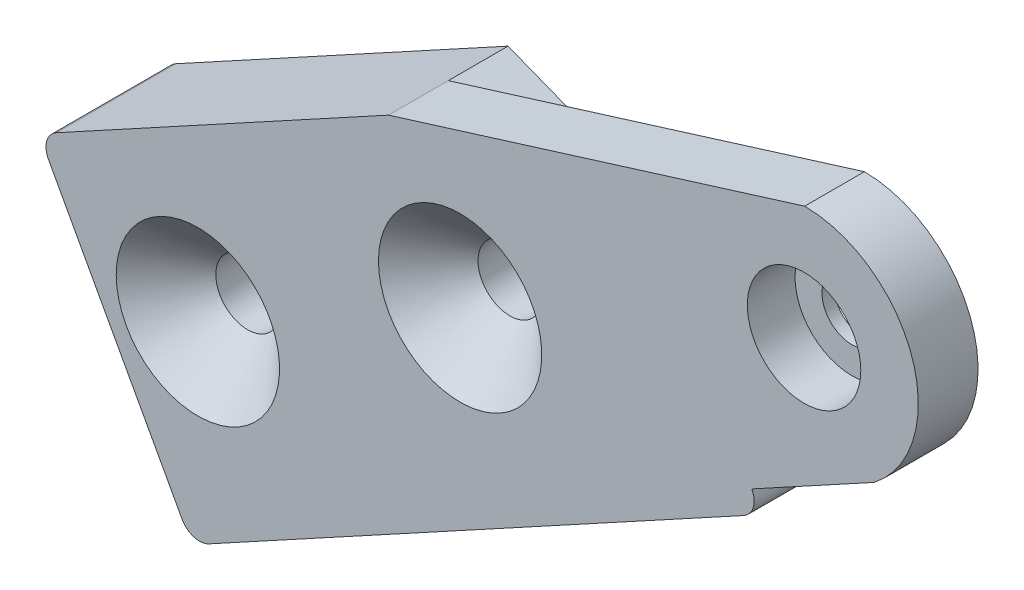
ISO-10303-21;
HEADER;
FILE_DESCRIPTION(('STEP AP214'),'2;1');
FILE_NAME('part.step','',(''),(''),'','','');
FILE_SCHEMA(('AUTOMOTIVE_DESIGN { 1 0 10303 214 1 1 1 1 }'));
ENDSEC;
DATA;
#1=APPLICATION_CONTEXT('core data for automotive mechanical design processes');
#2=APPLICATION_PROTOCOL_DEFINITION('international standard','automotive_design',2000,#1);
#3=PRODUCT_CONTEXT('',#1,'mechanical');
#4=PRODUCT('Part','Part','',(#3));
#5=PRODUCT_RELATED_PRODUCT_CATEGORY('part','',(#4));
#6=PRODUCT_DEFINITION_FORMATION('','',#4);
#7=PRODUCT_DEFINITION_CONTEXT('part definition',#1,'design');
#8=PRODUCT_DEFINITION('design','',#6,#7);
#9=PRODUCT_DEFINITION_SHAPE('','',#8);
#10=(LENGTH_UNIT() NAMED_UNIT(*) SI_UNIT(.MILLI.,.METRE.));
#11=(NAMED_UNIT(*) PLANE_ANGLE_UNIT() SI_UNIT($,.RADIAN.));
#12=(NAMED_UNIT(*) SI_UNIT($,.STERADIAN.) SOLID_ANGLE_UNIT());
#13=UNCERTAINTY_MEASURE_WITH_UNIT(LENGTH_MEASURE(1.E-05),#10,'distance_accuracy_value','');
#14=(GEOMETRIC_REPRESENTATION_CONTEXT(3) GLOBAL_UNCERTAINTY_ASSIGNED_CONTEXT((#13)) GLOBAL_UNIT_ASSIGNED_CONTEXT((#10,
#11,#12)) REPRESENTATION_CONTEXT('',''));
#15=CARTESIAN_POINT('',(0.,0.,0.));
#16=DIRECTION('',(0.,0.,1.));
#17=DIRECTION('',(1.,0.,0.));
#18=AXIS2_PLACEMENT_3D('',#15,#16,#17);
#19=CARTESIAN_POINT('',(0.,0.,0.));
#20=DIRECTION('',(0.,0.,-1.));
#21=DIRECTION('',(-1.,0.,0.));
#22=AXIS2_PLACEMENT_3D('',#19,#20,#21);
#23=PLANE('',#22);
#24=DIRECTION('',(0.479149191424604,-0.877733474556569,0.));
#25=VECTOR('',#24,1.);
#26=CARTESIAN_POINT('',(235.433373737078,168.203524869368,0.));
#27=LINE('',#26,#25);
#28=CARTESIAN_POINT('',(228.246135865709,181.369526987717,0.));
#29=VERTEX_POINT('',#28);
#30=CARTESIAN_POINT('',(234.954224545653,169.081258343925,0.));
#31=VERTEX_POINT('',#30);
#32=EDGE_CURVE('E201',#29,#31,#27,.T.);
#33=ORIENTED_EDGE('',*,*,#32,.F.);
#34=CARTESIAN_POINT('',(229.123869340265,181.848676179141,0.));
#35=DIRECTION('',(0.,0.,-1.));
#36=DIRECTION('',(-1.,0.,0.));
#37=AXIS2_PLACEMENT_3D('',#34,#35,#36);
#38=CIRCLE('',#37,1.);
#39=CARTESIAN_POINT('',(228.644720148841,182.726409653698,0.));
#40=VERTEX_POINT('',#39);
#41=EDGE_CURVE('E49',#29,#40,#38,.T.);
#42=ORIENTED_EDGE('',*,*,#41,.T.);
#43=DIRECTION('',(-0.877733474556571,-0.479149191424602,0.));
#44=VECTOR('',#43,1.);
#45=CARTESIAN_POINT('',(227.766986674284,182.247260462273,0.));
#46=LINE('',#45,#44);
#47=CARTESIAN_POINT('',(245.321656165416,191.830244290765,0.));
#48=VERTEX_POINT('',#47);
#49=EDGE_CURVE('E205',#48,#40,#46,.T.);
#50=ORIENTED_EDGE('',*,*,#49,.F.);
#51=DIRECTION('',(-0.931245777567846,0.364391687284519,0.));
#52=VECTOR('',#51,1.);
#53=CARTESIAN_POINT('',(245.321656165416,191.830244290765,0.));
#54=LINE('',#53,#52);
#55=CARTESIAN_POINT('',(263.55648155837,184.695050819466,0.));
#56=VERTEX_POINT('',#55);
#57=EDGE_CURVE('E197',#56,#48,#54,.T.);
#58=ORIENTED_EDGE('',*,*,#57,.F.);
#59=DIRECTION('',(0.877733474556571,0.479149191424601,0.));
#60=VECTOR('',#59,1.);
#61=CARTESIAN_POINT('',(234.954224545653,169.081258343925,0.));
#62=LINE('',#61,#60);
#63=EDGE_CURVE('E170',#31,#56,#62,.T.);
#64=ORIENTED_EDGE('',*,*,#63,.F.);
#65=EDGE_LOOP('',(#33,#42,#50,#58,#64));
#66=FACE_BOUND('',#65,.T.);
#67=CARTESIAN_POINT('',(235.749272982751,178.060005360222,0.));
#68=DIRECTION('',(0.,0.,1.));
#69=DIRECTION('',(1.,0.,0.));
#70=AXIS2_PLACEMENT_3D('',#67,#68,#69);
#71=CIRCLE('',#70,1.59999999999999);
#72=CARTESIAN_POINT('',(237.349272982751,178.060005360222,0.));
#73=VERTEX_POINT('',#72);
#74=EDGE_CURVE('E193',#73,#73,#71,.T.);
#75=ORIENTED_EDGE('',*,*,#74,.T.);
#76=EDGE_LOOP('',(#75));
#77=FACE_BOUND('',#76,.T.);
#78=CARTESIAN_POINT('',(248.9152751011,185.247243231591,0.));
#79=DIRECTION('',(0.,0.,1.));
#80=DIRECTION('',(1.,0.,0.));
#81=AXIS2_PLACEMENT_3D('',#78,#79,#80);
#82=CIRCLE('',#81,1.59999999999996);
#83=CARTESIAN_POINT('',(250.5152751011,185.247243231591,0.));
#84=VERTEX_POINT('',#83);
#85=EDGE_CURVE('E189',#84,#84,#82,.T.);
#86=ORIENTED_EDGE('',*,*,#85,.T.);
#87=EDGE_LOOP('',(#86));
#88=FACE_BOUND('',#87,.T.);
#89=ADVANCED_FACE('F40',(#66,#77,#88),#23,.T.);
#90=CARTESIAN_POINT('',(245.321656165416,191.830244290765,3.));
#91=DIRECTION('',(-0.364391687284519,-0.931245777567846,0.));
#92=DIRECTION('',(0.931245777567846,-0.364391687284519,0.));
#93=AXIS2_PLACEMENT_3D('',#90,#91,#92);
#94=PLANE('',#93);
#95=ORIENTED_EDGE('',*,*,#57,.T.);
#96=DIRECTION('',(0.,0.,-1.));
#97=VECTOR('',#96,1.);
#98=CARTESIAN_POINT('',(245.321656165416,191.830244290765,3.));
#99=LINE('',#98,#97);
#100=CARTESIAN_POINT('',(245.321656165416,191.830244290765,3.));
#101=VERTEX_POINT('',#100);
#102=EDGE_CURVE('E213',#101,#48,#99,.T.);
#103=ORIENTED_EDGE('',*,*,#102,.F.);
#104=DIRECTION('',(-0.931245777567846,0.364391687284519,0.));
#105=VECTOR('',#104,1.);
#106=CARTESIAN_POINT('',(245.321656165416,191.830244290765,3.));
#107=LINE('',#106,#105);
#108=CARTESIAN_POINT('',(263.55648155837,184.695050819466,3.));
#109=VERTEX_POINT('',#108);
#110=EDGE_CURVE('E143',#109,#101,#107,.T.);
#111=ORIENTED_EDGE('',*,*,#110,.F.);
#112=DIRECTION('',(0.,0.,-1.));
#113=VECTOR('',#112,1.);
#114=CARTESIAN_POINT('',(263.55648155837,184.695050819466,3.));
#115=LINE('',#114,#113);
#116=EDGE_CURVE('E200',#109,#56,#115,.T.);
#117=ORIENTED_EDGE('',*,*,#116,.T.);
#118=EDGE_LOOP('',(#95,#103,#111,#117));
#119=FACE_BOUND('',#118,.T.);
#120=ADVANCED_FACE('F326',(#119),#94,.F.);
#121=CARTESIAN_POINT('',(227.766986674284,182.247260462273,3.));
#122=DIRECTION('',(0.479149191424602,-0.877733474556571,0.));
#123=DIRECTION('',(0.877733474556571,0.479149191424602,0.));
#124=AXIS2_PLACEMENT_3D('',#121,#122,#123);
#125=PLANE('',#124);
#126=ORIENTED_EDGE('',*,*,#49,.T.);
#127=DIRECTION('',(0.,0.,-1.));
#128=VECTOR('',#127,1.);
#129=CARTESIAN_POINT('',(228.644720148841,182.726409653698,3.));
#130=LINE('',#129,#128);
#131=CARTESIAN_POINT('',(228.644720148841,182.726409653698,6.));
#132=VERTEX_POINT('',#131);
#133=EDGE_CURVE('E11',#40,#132,#130,.F.);
#134=ORIENTED_EDGE('',*,*,#133,.T.);
#135=DIRECTION('',(-0.877733474556571,-0.479149191424602,0.));
#136=VECTOR('',#135,1.);
#137=CARTESIAN_POINT('',(227.766986674284,182.247260462273,6.));
#138=LINE('',#137,#136);
#139=CARTESIAN_POINT('',(245.321656165416,191.830244290765,6.));
#140=VERTEX_POINT('',#139);
#141=EDGE_CURVE('E134',#140,#132,#138,.T.);
#142=ORIENTED_EDGE('',*,*,#141,.F.);
#143=DIRECTION('',(0.,0.,-1.));
#144=VECTOR('',#143,1.);
#145=CARTESIAN_POINT('',(245.321656165416,191.830244290765,7.6));
#146=LINE('',#145,#144);
#147=EDGE_CURVE('E145',#140,#101,#146,.T.);
#148=ORIENTED_EDGE('',*,*,#147,.T.);
#149=ORIENTED_EDGE('',*,*,#102,.T.);
#150=EDGE_LOOP('',(#126,#134,#142,#148,#149));
#151=FACE_BOUND('',#150,.T.);
#152=ADVANCED_FACE('F331',(#151),#125,.F.);
#153=CARTESIAN_POINT('',(235.433373737078,168.203524869368,3.));
#154=DIRECTION('',(0.877733474556569,0.479149191424604,0.));
#155=DIRECTION('',(-0.479149191424605,0.877733474556569,0.));
#156=AXIS2_PLACEMENT_3D('',#153,#154,#155);
#157=PLANE('',#156);
#158=DIRECTION('',(0.479149191424604,-0.877733474556569,0.));
#159=VECTOR('',#158,1.);
#160=CARTESIAN_POINT('',(234.954224545653,169.081258343925,6.));
#161=LINE('',#160,#159);
#162=CARTESIAN_POINT('',(228.246135865709,181.369526987717,6.));
#163=VERTEX_POINT('',#162);
#164=CARTESIAN_POINT('',(234.954224545653,169.081258343925,6.));
#165=VERTEX_POINT('',#164);
#166=EDGE_CURVE('E152',#163,#165,#161,.T.);
#167=ORIENTED_EDGE('',*,*,#166,.F.);
#168=DIRECTION('',(0.,0.,-1.));
#169=VECTOR('',#168,1.);
#170=CARTESIAN_POINT('',(228.246135865709,181.369526987717,3.));
#171=LINE('',#170,#169);
#172=EDGE_CURVE('E262',#163,#29,#171,.T.);
#173=ORIENTED_EDGE('',*,*,#172,.T.);
#174=ORIENTED_EDGE('',*,*,#32,.T.);
#175=DIRECTION('',(0.,0.,-1.));
#176=VECTOR('',#175,1.);
#177=CARTESIAN_POINT('',(234.954224545653,169.081258343925,3.));
#178=LINE('',#177,#176);
#179=EDGE_CURVE('E259',#31,#165,#178,.F.);
#180=ORIENTED_EDGE('',*,*,#179,.T.);
#181=EDGE_LOOP('',(#167,#173,#174,#180));
#182=FACE_BOUND('',#181,.T.);
#183=ADVANCED_FACE('F342',(#182),#157,.F.);
#184=CARTESIAN_POINT('',(264.035630749795,183.817317344909,3.));
#185=DIRECTION('',(-0.479149191424602,0.877733474556571,0.));
#186=DIRECTION('',(-0.877733474556571,-0.479149191424602,0.));
#187=AXIS2_PLACEMENT_3D('',#184,#185,#186);
#188=PLANE('',#187);
#189=DIRECTION('',(-0.877733474556571,-0.479149191424602,0.));
#190=VECTOR('',#189,1.);
#191=CARTESIAN_POINT('',(264.035630749795,183.817317344909,-1.4));
#192=LINE('',#191,#190);
#193=CARTESIAN_POINT('',(263.157897275238,183.338168153485,-1.4));
#194=VERTEX_POINT('',#193);
#195=CARTESIAN_POINT('',(236.311107211634,168.682674060793,-1.4));
#196=VERTEX_POINT('',#195);
#197=EDGE_CURVE('E174',#194,#196,#192,.T.);
#198=ORIENTED_EDGE('',*,*,#197,.F.);
#199=DIRECTION('',(0.,0.,-1.));
#200=VECTOR('',#199,1.);
#201=CARTESIAN_POINT('',(263.157897275238,183.338168153485,3.));
#202=LINE('',#201,#200);
#203=CARTESIAN_POINT('',(263.157897275238,183.338168153485,6.));
#204=VERTEX_POINT('',#203);
#205=EDGE_CURVE('E247',#194,#204,#202,.F.);
#206=ORIENTED_EDGE('',*,*,#205,.T.);
#207=DIRECTION('',(0.877733474556571,0.479149191424601,0.));
#208=VECTOR('',#207,1.);
#209=CARTESIAN_POINT('',(235.433373737078,168.203524869368,6.));
#210=LINE('',#209,#208);
#211=CARTESIAN_POINT('',(236.311107211634,168.682674060793,6.));
#212=VERTEX_POINT('',#211);
#213=EDGE_CURVE('E158',#212,#204,#210,.T.);
#214=ORIENTED_EDGE('',*,*,#213,.F.);
#215=DIRECTION('',(0.,0.,-1.));
#216=VECTOR('',#215,1.);
#217=CARTESIAN_POINT('',(236.311107211634,168.682674060793,3.));
#218=LINE('',#217,#216);
#219=EDGE_CURVE('E243',#212,#196,#218,.T.);
#220=ORIENTED_EDGE('',*,*,#219,.T.);
#221=EDGE_LOOP('',(#198,#206,#214,#220));
#222=FACE_BOUND('',#221,.T.);
#223=ADVANCED_FACE('F339',(#222),#188,.F.);
#224=CARTESIAN_POINT('',(235.749272982751,178.060005360222,3.));
#225=DIRECTION('',(0.,0.,-1.));
#226=DIRECTION('',(-1.,0.,0.));
#227=AXIS2_PLACEMENT_3D('',#224,#225,#226);
#228=CYLINDRICAL_SURFACE('',#227,1.59999999999999);
#229=CARTESIAN_POINT('',(235.749272982751,178.060005360222,3.49999999999999));
#230=DIRECTION('',(0.,0.,-1.));
#231=DIRECTION('',(-1.,0.,0.));
#232=AXIS2_PLACEMENT_3D('',#229,#230,#231);
#233=CIRCLE('',#232,1.59999999999999);
#234=CARTESIAN_POINT('',(234.149272982751,178.060005360222,3.49999999999999));
#235=VERTEX_POINT('',#234);
#236=EDGE_CURVE('E217',#235,#235,#233,.F.);
#237=ORIENTED_EDGE('',*,*,#236,.T.);
#238=EDGE_LOOP('',(#237));
#239=FACE_BOUND('',#238,.T.);
#240=ORIENTED_EDGE('',*,*,#74,.F.);
#241=EDGE_LOOP('',(#240));
#242=FACE_BOUND('',#241,.T.);
#243=ADVANCED_FACE('F337',(#239,#242),#228,.F.);
#244=CARTESIAN_POINT('',(248.9152751011,185.247243231591,3.));
#245=DIRECTION('',(0.,0.,-1.));
#246=DIRECTION('',(-1.,0.,0.));
#247=AXIS2_PLACEMENT_3D('',#244,#245,#246);
#248=CYLINDRICAL_SURFACE('',#247,1.59999999999996);
#249=CARTESIAN_POINT('',(248.9152751011,185.247243231591,3.49999999999999));
#250=DIRECTION('',(0.,0.,-1.));
#251=DIRECTION('',(-1.,0.,0.));
#252=AXIS2_PLACEMENT_3D('',#249,#250,#251);
#253=CIRCLE('',#252,1.59999999999996);
#254=CARTESIAN_POINT('',(247.3152751011,185.247243231591,3.49999999999999));
#255=VERTEX_POINT('',#254);
#256=EDGE_CURVE('E233',#255,#255,#253,.F.);
#257=ORIENTED_EDGE('',*,*,#256,.T.);
#258=EDGE_LOOP('',(#257));
#259=FACE_BOUND('',#258,.T.);
#260=ORIENTED_EDGE('',*,*,#85,.F.);
#261=EDGE_LOOP('',(#260));
#262=FACE_BOUND('',#261,.T.);
#263=ADVANCED_FACE('F392',(#259,#262),#248,.F.);
#264=CARTESIAN_POINT('',(234.954224545653,169.081258343925,-1.4));
#265=DIRECTION('',(0.479149191424601,-0.877733474556571,0.));
#266=DIRECTION('',(0.877733474556571,0.479149191424601,0.));
#267=AXIS2_PLACEMENT_3D('',#264,#265,#266);
#268=PLANE('',#267);
#269=ORIENTED_EDGE('',*,*,#63,.T.);
#270=DIRECTION('',(0.,0.,1.));
#271=VECTOR('',#270,1.);
#272=CARTESIAN_POINT('',(263.55648155837,184.695050819466,-1.4));
#273=LINE('',#272,#271);
#274=CARTESIAN_POINT('',(263.55648155837,184.695050819466,-1.4));
#275=VERTEX_POINT('',#274);
#276=EDGE_CURVE('E185',#275,#56,#273,.T.);
#277=ORIENTED_EDGE('',*,*,#276,.F.);
#278=DIRECTION('',(0.877733474556571,0.479149191424601,0.));
#279=VECTOR('',#278,1.);
#280=CARTESIAN_POINT('',(234.954224545653,169.081258343925,-1.4));
#281=LINE('',#280,#279);
#282=CARTESIAN_POINT('',(234.954224545653,169.081258343925,-1.4));
#283=VERTEX_POINT('',#282);
#284=EDGE_CURVE('E171',#283,#275,#281,.T.);
#285=ORIENTED_EDGE('',*,*,#284,.F.);
#286=DIRECTION('',(0.,0.,1.));
#287=VECTOR('',#286,1.);
#288=CARTESIAN_POINT('',(234.954224545653,169.081258343925,-1.4));
#289=LINE('',#288,#287);
#290=EDGE_CURVE('E178',#283,#31,#289,.T.);
#291=ORIENTED_EDGE('',*,*,#290,.T.);
#292=EDGE_LOOP('',(#269,#277,#285,#291));
#293=FACE_BOUND('',#292,.T.);
#294=ADVANCED_FACE('F321',(#293),#268,.F.);
#295=CARTESIAN_POINT('',(0.,0.,-1.4));
#296=DIRECTION('',(0.,0.,-1.));
#297=DIRECTION('',(-1.,0.,0.));
#298=AXIS2_PLACEMENT_3D('',#295,#296,#297);
#299=PLANE('',#298);
#300=ORIENTED_EDGE('',*,*,#284,.T.);
#301=CARTESIAN_POINT('',(262.678748083814,184.215901628041,-1.4));
#302=DIRECTION('',(0.,0.,-1.));
#303=DIRECTION('',(-1.,0.,0.));
#304=AXIS2_PLACEMENT_3D('',#301,#302,#303);
#305=CIRCLE('',#304,1.);
#306=EDGE_CURVE('E240',#275,#194,#305,.T.);
#307=ORIENTED_EDGE('',*,*,#306,.T.);
#308=ORIENTED_EDGE('',*,*,#197,.T.);
#309=CARTESIAN_POINT('',(235.83195802021,169.560407535349,-1.4));
#310=DIRECTION('',(0.,0.,-1.));
#311=DIRECTION('',(-1.,0.,0.));
#312=AXIS2_PLACEMENT_3D('',#309,#310,#311);
#313=CIRCLE('',#312,1.);
#314=EDGE_CURVE('E237',#196,#283,#313,.T.);
#315=ORIENTED_EDGE('',*,*,#314,.T.);
#316=EDGE_LOOP('',(#300,#307,#308,#315));
#317=FACE_BOUND('',#316,.T.);
#318=ADVANCED_FACE('F311',(#317),#299,.T.);
#319=CARTESIAN_POINT('',(266.183352442262,192.580788531567,6.));
#320=DIRECTION('',(0.,0.,-1.));
#321=DIRECTION('',(-1.,0.,0.));
#322=AXIS2_PLACEMENT_3D('',#319,#320,#321);
#323=PLANE('',#322);
#324=CARTESIAN_POINT('',(235.749272982751,178.060005360222,6.));
#325=DIRECTION('',(0.,0.,-1.));
#326=DIRECTION('',(-1.,0.,0.));
#327=AXIS2_PLACEMENT_3D('',#324,#325,#326);
#328=CIRCLE('',#327,4.09999999999999);
#329=CARTESIAN_POINT('',(231.649272982751,178.060005360222,6.));
#330=VERTEX_POINT('',#329);
#331=EDGE_CURVE('E229',#330,#330,#328,.T.);
#332=ORIENTED_EDGE('',*,*,#331,.T.);
#333=EDGE_LOOP('',(#332));
#334=FACE_BOUND('',#333,.T.);
#335=CARTESIAN_POINT('',(248.9152751011,185.247243231591,6.));
#336=DIRECTION('',(0.,0.,-1.));
#337=DIRECTION('',(-1.,0.,0.));
#338=AXIS2_PLACEMENT_3D('',#335,#336,#337);
#339=CIRCLE('',#338,4.09999999999999);
#340=CARTESIAN_POINT('',(244.8152751011,185.247243231591,6.));
#341=VERTEX_POINT('',#340);
#342=EDGE_CURVE('E225',#341,#341,#339,.T.);
#343=ORIENTED_EDGE('',*,*,#342,.T.);
#344=EDGE_LOOP('',(#343));
#345=FACE_BOUND('',#344,.T.);
#346=CARTESIAN_POINT('',(266.183352442262,192.580788531567,6.));
#347=DIRECTION('',(0.,0.,1.));
#348=DIRECTION('',(1.,0.,0.));
#349=AXIS2_PLACEMENT_3D('',#346,#347,#348);
#350=CIRCLE('',#349,2.85000000000003);
#351=CARTESIAN_POINT('',(269.033352442262,192.580788531567,6.));
#352=VERTEX_POINT('',#351);
#353=EDGE_CURVE('E280',#352,#352,#350,.T.);
#354=ORIENTED_EDGE('',*,*,#353,.F.);
#355=EDGE_LOOP('',(#354));
#356=FACE_BOUND('',#355,.T.);
#357=ORIENTED_EDGE('',*,*,#213,.T.);
#358=CARTESIAN_POINT('',(262.678748083814,184.215901628041,6.));
#359=DIRECTION('',(0.,0.,-1.));
#360=DIRECTION('',(-1.,0.,0.));
#361=AXIS2_PLACEMENT_3D('',#358,#359,#360);
#362=CIRCLE('',#361,1.);
#363=CARTESIAN_POINT('',(263.55648155837,184.695050819466,6.));
#364=VERTEX_POINT('',#363);
#365=EDGE_CURVE('E256',#204,#364,#362,.F.);
#366=ORIENTED_EDGE('',*,*,#365,.T.);
#367=DIRECTION('',(0.87773347455657,0.479149191424603,0.));
#368=VECTOR('',#367,1.);
#369=CARTESIAN_POINT('',(269.700615880266,188.049095159438,6.));
#370=LINE('',#369,#368);
#371=CARTESIAN_POINT('',(269.700615880266,188.049095159438,6.));
#372=VERTEX_POINT('',#371);
#373=EDGE_CURVE('E270',#364,#372,#370,.T.);
#374=ORIENTED_EDGE('',*,*,#373,.T.);
#375=CARTESIAN_POINT('',(266.183352442262,192.580788531567,6.));
#376=DIRECTION('',(0.,0.,1.));
#377=DIRECTION('',(-1.,0.,0.));
#378=AXIS2_PLACEMENT_3D('',#375,#376,#377);
#379=CIRCLE('',#378,5.73649604822649);
#380=CARTESIAN_POINT('',(266.21359493017,198.317204860883,6.));
#381=VERTEX_POINT('',#380);
#382=EDGE_CURVE('E268',#372,#381,#379,.T.);
#383=ORIENTED_EDGE('',*,*,#382,.T.);
#384=DIRECTION('',(-0.955022000855883,-0.296534952208381,0.));
#385=VECTOR('',#384,1.);
#386=CARTESIAN_POINT('',(264.561473545103,197.804220096632,6.));
#387=LINE('',#386,#385);
#388=EDGE_CURVE('E127',#381,#140,#387,.T.);
#389=ORIENTED_EDGE('',*,*,#388,.T.);
#390=ORIENTED_EDGE('',*,*,#141,.T.);
#391=CARTESIAN_POINT('',(229.123869340265,181.848676179141,6.));
#392=DIRECTION('',(0.,0.,-1.));
#393=DIRECTION('',(-1.,0.,0.));
#394=AXIS2_PLACEMENT_3D('',#391,#392,#393);
#395=CIRCLE('',#394,1.);
#396=EDGE_CURVE('E253',#132,#163,#395,.F.);
#397=ORIENTED_EDGE('',*,*,#396,.T.);
#398=ORIENTED_EDGE('',*,*,#166,.T.);
#399=CARTESIAN_POINT('',(235.83195802021,169.560407535349,6.));
#400=DIRECTION('',(0.,0.,-1.));
#401=DIRECTION('',(-1.,0.,0.));
#402=AXIS2_PLACEMENT_3D('',#399,#400,#401);
#403=CIRCLE('',#402,1.);
#404=EDGE_CURVE('E250',#165,#212,#403,.F.);
#405=ORIENTED_EDGE('',*,*,#404,.T.);
#406=EDGE_LOOP('',(#357,#366,#374,#383,#389,#390,#397,#398,#405));
#407=FACE_BOUND('',#406,.T.);
#408=ADVANCED_FACE('F309',(#334,#345,#356,#407),#323,.F.);
#409=CARTESIAN_POINT('',(266.183352442262,192.580788531567,3.));
#410=DIRECTION('',(0.,0.,-1.));
#411=DIRECTION('',(-1.,0.,0.));
#412=AXIS2_PLACEMENT_3D('',#409,#410,#411);
#413=PLANE('',#412);
#414=CARTESIAN_POINT('',(266.183352442262,192.580788531567,3.));
#415=DIRECTION('',(0.,0.,-1.));
#416=DIRECTION('',(-1.,0.,0.));
#417=AXIS2_PLACEMENT_3D('',#414,#415,#416);
#418=CIRCLE('',#417,1.50000000000002);
#419=CARTESIAN_POINT('',(264.683352442262,192.580788531567,3.));
#420=VERTEX_POINT('',#419);
#421=EDGE_CURVE('E146',#420,#420,#418,.T.);
#422=ORIENTED_EDGE('',*,*,#421,.F.);
#423=EDGE_LOOP('',(#422));
#424=FACE_BOUND('',#423,.T.);
#425=DIRECTION('',(-0.955022000855883,-0.296534952208381,0.));
#426=VECTOR('',#425,1.);
#427=CARTESIAN_POINT('',(245.321656165416,191.830244290765,3.));
#428=LINE('',#427,#426);
#429=CARTESIAN_POINT('',(266.21359493017,198.317204860883,3.));
#430=VERTEX_POINT('',#429);
#431=EDGE_CURVE('E124',#430,#101,#428,.T.);
#432=ORIENTED_EDGE('',*,*,#431,.F.);
#433=CARTESIAN_POINT('',(266.183352442262,192.580788531567,3.));
#434=DIRECTION('',(0.,0.,1.));
#435=DIRECTION('',(-1.,0.,0.));
#436=AXIS2_PLACEMENT_3D('',#433,#434,#435);
#437=CIRCLE('',#436,5.73649604822649);
#438=CARTESIAN_POINT('',(269.700615880266,188.049095159438,3.));
#439=VERTEX_POINT('',#438);
#440=EDGE_CURVE('E141',#439,#430,#437,.T.);
#441=ORIENTED_EDGE('',*,*,#440,.F.);
#442=DIRECTION('',(0.87773347455657,0.479149191424603,0.));
#443=VECTOR('',#442,1.);
#444=CARTESIAN_POINT('',(269.700615880266,188.049095159438,3.));
#445=LINE('',#444,#443);
#446=EDGE_CURVE('E153',#109,#439,#445,.T.);
#447=ORIENTED_EDGE('',*,*,#446,.F.);
#448=ORIENTED_EDGE('',*,*,#110,.T.);
#449=EDGE_LOOP('',(#432,#441,#447,#448));
#450=FACE_BOUND('',#449,.T.);
#451=ADVANCED_FACE('F139',(#424,#450),#413,.T.);
#452=CARTESIAN_POINT('',(269.700615880266,188.049095159438,6.));
#453=DIRECTION('',(-0.479149191424603,0.87773347455657,0.));
#454=DIRECTION('',(-0.87773347455657,-0.479149191424603,0.));
#455=AXIS2_PLACEMENT_3D('',#452,#453,#454);
#456=PLANE('',#455);
#457=ORIENTED_EDGE('',*,*,#446,.T.);
#458=DIRECTION('',(0.,0.,-1.));
#459=VECTOR('',#458,1.);
#460=CARTESIAN_POINT('',(269.700615880266,188.049095159438,6.));
#461=LINE('',#460,#459);
#462=EDGE_CURVE('E133',#372,#439,#461,.T.);
#463=ORIENTED_EDGE('',*,*,#462,.F.);
#464=ORIENTED_EDGE('',*,*,#373,.F.);
#465=DIRECTION('',(0.,0.,-1.));
#466=VECTOR('',#465,1.);
#467=CARTESIAN_POINT('',(263.55648155837,184.695050819466,6.));
#468=LINE('',#467,#466);
#469=EDGE_CURVE('E166',#364,#109,#468,.T.);
#470=ORIENTED_EDGE('',*,*,#469,.T.);
#471=EDGE_LOOP('',(#457,#463,#464,#470));
#472=FACE_BOUND('',#471,.T.);
#473=ADVANCED_FACE('F318',(#472),#456,.F.);
#474=CARTESIAN_POINT('',(266.183352442262,192.580788531567,6.));
#475=DIRECTION('',(0.,0.,-1.));
#476=DIRECTION('',(-1.,0.,0.));
#477=AXIS2_PLACEMENT_3D('',#474,#475,#476);
#478=CYLINDRICAL_SURFACE('',#477,5.73649604822649);
#479=ORIENTED_EDGE('',*,*,#440,.T.);
#480=DIRECTION('',(0.,0.,-1.));
#481=VECTOR('',#480,1.);
#482=CARTESIAN_POINT('',(266.21359493017,198.317204860883,6.));
#483=LINE('',#482,#481);
#484=EDGE_CURVE('E121',#381,#430,#483,.T.);
#485=ORIENTED_EDGE('',*,*,#484,.F.);
#486=ORIENTED_EDGE('',*,*,#382,.F.);
#487=ORIENTED_EDGE('',*,*,#462,.T.);
#488=EDGE_LOOP('',(#479,#485,#486,#487));
#489=FACE_BOUND('',#488,.T.);
#490=ADVANCED_FACE('F149',(#489),#478,.T.);
#491=CARTESIAN_POINT('',(266.183352442262,192.580788531567,3.6));
#492=DIRECTION('',(0.,0.,1.));
#493=DIRECTION('',(1.,0.,0.));
#494=AXIS2_PLACEMENT_3D('',#491,#492,#493);
#495=CYLINDRICAL_SURFACE('',#494,2.85000000000003);
#496=CARTESIAN_POINT('',(266.183352442262,192.580788531567,3.6));
#497=DIRECTION('',(0.,0.,1.));
#498=DIRECTION('',(1.,0.,0.));
#499=AXIS2_PLACEMENT_3D('',#496,#497,#498);
#500=CIRCLE('',#499,2.85000000000003);
#501=CARTESIAN_POINT('',(269.033352442262,192.580788531567,3.6));
#502=VERTEX_POINT('',#501);
#503=EDGE_CURVE('E160',#502,#502,#500,.T.);
#504=ORIENTED_EDGE('',*,*,#503,.F.);
#505=EDGE_LOOP('',(#504));
#506=FACE_BOUND('',#505,.T.);
#507=ORIENTED_EDGE('',*,*,#353,.T.);
#508=EDGE_LOOP('',(#507));
#509=FACE_BOUND('',#508,.T.);
#510=ADVANCED_FACE('F300',(#506,#509),#495,.F.);
#511=CARTESIAN_POINT('',(266.183352442262,192.580788531567,3.6));
#512=DIRECTION('',(0.,0.,1.));
#513=DIRECTION('',(1.,0.,0.));
#514=AXIS2_PLACEMENT_3D('',#511,#512,#513);
#515=PLANE('',#514);
#516=CARTESIAN_POINT('',(266.183352442262,192.580788531567,3.6));
#517=DIRECTION('',(0.,0.,1.));
#518=DIRECTION('',(1.,0.,0.));
#519=AXIS2_PLACEMENT_3D('',#516,#517,#518);
#520=CIRCLE('',#519,1.50000000000002);
#521=CARTESIAN_POINT('',(267.683352442262,192.580788531567,3.6));
#522=VERTEX_POINT('',#521);
#523=EDGE_CURVE('E221',#522,#522,#520,.T.);
#524=ORIENTED_EDGE('',*,*,#523,.F.);
#525=EDGE_LOOP('',(#524));
#526=FACE_BOUND('',#525,.T.);
#527=ORIENTED_EDGE('',*,*,#503,.T.);
#528=EDGE_LOOP('',(#527));
#529=FACE_BOUND('',#528,.T.);
#530=ADVANCED_FACE('F297',(#526,#529),#515,.T.);
#531=CARTESIAN_POINT('',(245.321656165416,191.830244290765,7.6));
#532=DIRECTION('',(0.296534952208381,-0.955022000855883,0.));
#533=DIRECTION('',(0.955022000855883,0.296534952208381,0.));
#534=AXIS2_PLACEMENT_3D('',#531,#532,#533);
#535=PLANE('',#534);
#536=ORIENTED_EDGE('',*,*,#484,.T.);
#537=ORIENTED_EDGE('',*,*,#431,.T.);
#538=ORIENTED_EDGE('',*,*,#147,.F.);
#539=ORIENTED_EDGE('',*,*,#388,.F.);
#540=EDGE_LOOP('',(#536,#537,#538,#539));
#541=FACE_BOUND('',#540,.T.);
#542=ADVANCED_FACE('F123',(#541),#535,.F.);
#543=CARTESIAN_POINT('',(266.183352442262,192.580788531567,-6.4));
#544=DIRECTION('',(0.,0.,1.));
#545=DIRECTION('',(1.,0.,0.));
#546=AXIS2_PLACEMENT_3D('',#543,#544,#545);
#547=CYLINDRICAL_SURFACE('',#546,1.50000000000002);
#548=ORIENTED_EDGE('',*,*,#421,.T.);
#549=EDGE_LOOP('',(#548));
#550=FACE_BOUND('',#549,.T.);
#551=ORIENTED_EDGE('',*,*,#523,.T.);
#552=EDGE_LOOP('',(#551));
#553=FACE_BOUND('',#552,.T.);
#554=ADVANCED_FACE('F295',(#550,#553),#547,.F.);
#555=CARTESIAN_POINT('',(235.749272982751,178.060005360222,3.49999999999999));
#556=DIRECTION('',(0.,0.,1.));
#557=DIRECTION('',(1.,0.,0.));
#558=AXIS2_PLACEMENT_3D('',#555,#556,#557);
#559=CONICAL_SURFACE('',#558,1.59999999999999,0.785398163397447);
#560=ORIENTED_EDGE('',*,*,#331,.F.);
#561=EDGE_LOOP('',(#560));
#562=FACE_BOUND('',#561,.T.);
#563=ORIENTED_EDGE('',*,*,#236,.F.);
#564=EDGE_LOOP('',(#563));
#565=FACE_BOUND('',#564,.T.);
#566=ADVANCED_FACE('F351',(#562,#565),#559,.F.);
#567=CARTESIAN_POINT('',(248.9152751011,185.247243231591,3.49999999999999));
#568=DIRECTION('',(0.,0.,1.));
#569=DIRECTION('',(1.,0.,0.));
#570=AXIS2_PLACEMENT_3D('',#567,#568,#569);
#571=CONICAL_SURFACE('',#570,1.59999999999996,0.785398163397453);
#572=ORIENTED_EDGE('',*,*,#342,.F.);
#573=EDGE_LOOP('',(#572));
#574=FACE_BOUND('',#573,.T.);
#575=ORIENTED_EDGE('',*,*,#256,.F.);
#576=EDGE_LOOP('',(#575));
#577=FACE_BOUND('',#576,.T.);
#578=ADVANCED_FACE('F357',(#574,#577),#571,.F.);
#579=CARTESIAN_POINT('',(262.678748083814,184.215901628041,3.));
#580=DIRECTION('',(0.,0.,-1.));
#581=DIRECTION('',(-1.,0.,0.));
#582=AXIS2_PLACEMENT_3D('',#579,#580,#581);
#583=CYLINDRICAL_SURFACE('',#582,1.);
#584=ORIENTED_EDGE('',*,*,#365,.F.);
#585=ORIENTED_EDGE('',*,*,#205,.F.);
#586=ORIENTED_EDGE('',*,*,#306,.F.);
#587=ORIENTED_EDGE('',*,*,#276,.T.);
#588=ORIENTED_EDGE('',*,*,#116,.F.);
#589=ORIENTED_EDGE('',*,*,#469,.F.);
#590=EDGE_LOOP('',(#584,#585,#586,#587,#588,#589));
#591=FACE_BOUND('',#590,.T.);
#592=ADVANCED_FACE('F363',(#591),#583,.T.);
#593=CARTESIAN_POINT('',(229.123869340265,181.848676179141,3.));
#594=DIRECTION('',(0.,0.,-1.));
#595=DIRECTION('',(-1.,0.,0.));
#596=AXIS2_PLACEMENT_3D('',#593,#594,#595);
#597=CYLINDRICAL_SURFACE('',#596,1.);
#598=ORIENTED_EDGE('',*,*,#396,.F.);
#599=ORIENTED_EDGE('',*,*,#133,.F.);
#600=ORIENTED_EDGE('',*,*,#41,.F.);
#601=ORIENTED_EDGE('',*,*,#172,.F.);
#602=EDGE_LOOP('',(#598,#599,#600,#601));
#603=FACE_BOUND('',#602,.T.);
#604=ADVANCED_FACE('F366',(#603),#597,.T.);
#605=CARTESIAN_POINT('',(235.83195802021,169.560407535349,3.));
#606=DIRECTION('',(0.,0.,-1.));
#607=DIRECTION('',(-1.,0.,0.));
#608=AXIS2_PLACEMENT_3D('',#605,#606,#607);
#609=CYLINDRICAL_SURFACE('',#608,1.);
#610=ORIENTED_EDGE('',*,*,#179,.F.);
#611=ORIENTED_EDGE('',*,*,#290,.F.);
#612=ORIENTED_EDGE('',*,*,#314,.F.);
#613=ORIENTED_EDGE('',*,*,#219,.F.);
#614=ORIENTED_EDGE('',*,*,#404,.F.);
#615=EDGE_LOOP('',(#610,#611,#612,#613,#614));
#616=FACE_BOUND('',#615,.T.);
#617=ADVANCED_FACE('F42',(#616),#609,.T.);
#618=CLOSED_SHELL('',(#89,#120,#152,#183,#223,#243,#263,#294,#318,#408,#451,#473,#490,#510,#530,
#542,#554,#566,#578,#592,#604,#617));
#619=MANIFOLD_SOLID_BREP('B2',#618);
#620=ADVANCED_BREP_SHAPE_REPRESENTATION('',(#18,#619),#14);
#621=SHAPE_DEFINITION_REPRESENTATION(#9,#620);
ENDSEC;
END-ISO-10303-21;
